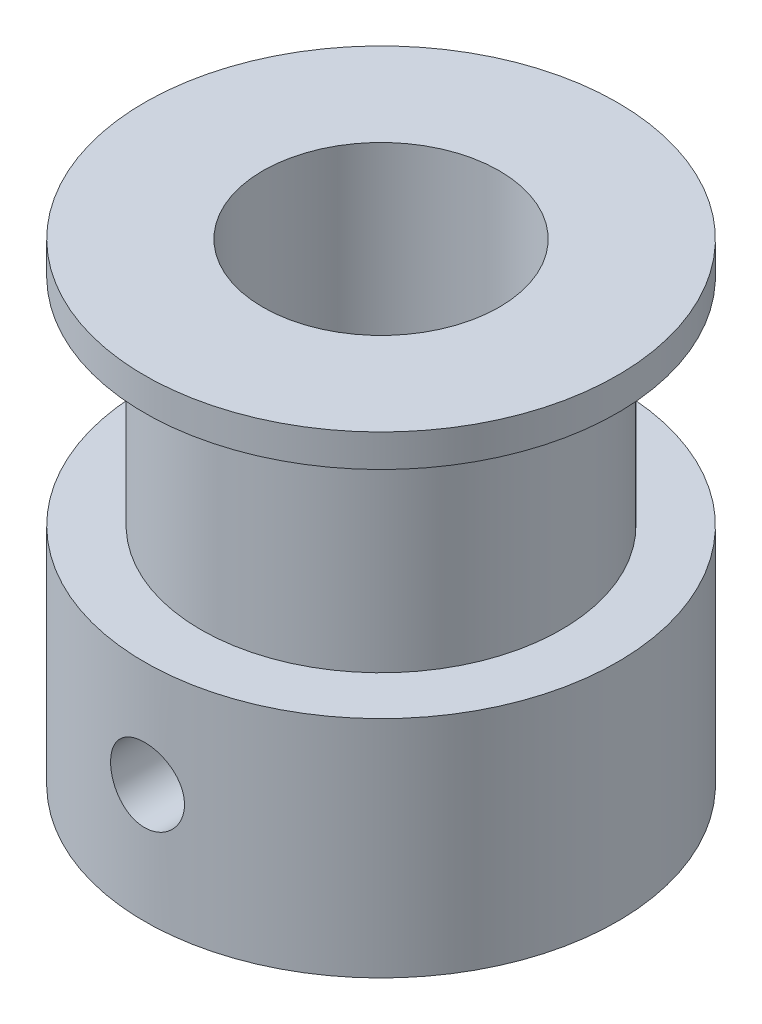
ISO-10303-21;
HEADER;
FILE_DESCRIPTION(('STEP AP214'),'2;1');
FILE_NAME('part.step','',(''),(''),'','','');
FILE_SCHEMA(('AUTOMOTIVE_DESIGN { 1 0 10303 214 1 1 1 1 }'));
ENDSEC;
DATA;
#1=APPLICATION_CONTEXT('core data for automotive mechanical design processes');
#2=APPLICATION_PROTOCOL_DEFINITION('international standard','automotive_design',2000,#1);
#3=PRODUCT_CONTEXT('',#1,'mechanical');
#4=PRODUCT('Part','Part','',(#3));
#5=PRODUCT_RELATED_PRODUCT_CATEGORY('part','',(#4));
#6=PRODUCT_DEFINITION_FORMATION('','',#4);
#7=PRODUCT_DEFINITION_CONTEXT('part definition',#1,'design');
#8=PRODUCT_DEFINITION('design','',#6,#7);
#9=PRODUCT_DEFINITION_SHAPE('','',#8);
#10=(LENGTH_UNIT() NAMED_UNIT(*) SI_UNIT(.MILLI.,.METRE.));
#11=(NAMED_UNIT(*) PLANE_ANGLE_UNIT() SI_UNIT($,.RADIAN.));
#12=(NAMED_UNIT(*) SI_UNIT($,.STERADIAN.) SOLID_ANGLE_UNIT());
#13=UNCERTAINTY_MEASURE_WITH_UNIT(LENGTH_MEASURE(1.E-05),#10,'distance_accuracy_value','');
#14=(GEOMETRIC_REPRESENTATION_CONTEXT(3) GLOBAL_UNCERTAINTY_ASSIGNED_CONTEXT((#13)) GLOBAL_UNIT_ASSIGNED_CONTEXT((#10,
#11,#12)) REPRESENTATION_CONTEXT('',''));
#15=CARTESIAN_POINT('',(0.,0.,0.));
#16=DIRECTION('',(0.,0.,1.));
#17=DIRECTION('',(1.,0.,0.));
#18=AXIS2_PLACEMENT_3D('',#15,#16,#17);
#19=CARTESIAN_POINT('',(-8.,16.,0.));
#20=DIRECTION('',(0.,-1.,0.));
#21=DIRECTION('',(0.,0.,-1.));
#22=AXIS2_PLACEMENT_3D('',#19,#20,#21);
#23=PLANE('',#22);
#24=CARTESIAN_POINT('',(0.,16.,0.));
#25=DIRECTION('',(0.,-1.,0.));
#26=DIRECTION('',(0.,0.,-1.));
#27=AXIS2_PLACEMENT_3D('',#24,#25,#26);
#28=CIRCLE('',#27,8.);
#29=CARTESIAN_POINT('',(0.,16.,-8.));
#30=VERTEX_POINT('',#29);
#31=EDGE_CURVE('E66',#30,#30,#28,.T.);
#32=ORIENTED_EDGE('',*,*,#31,.F.);
#33=EDGE_LOOP('',(#32));
#34=FACE_BOUND('',#33,.T.);
#35=CARTESIAN_POINT('',(0.,16.,0.));
#36=DIRECTION('',(0.,-1.,0.));
#37=DIRECTION('',(0.,0.,-1.));
#38=AXIS2_PLACEMENT_3D('',#35,#36,#37);
#39=CIRCLE('',#38,4.);
#40=CARTESIAN_POINT('',(0.,16.,-4.));
#41=VERTEX_POINT('',#40);
#42=EDGE_CURVE('E10',#41,#41,#39,.T.);
#43=ORIENTED_EDGE('',*,*,#42,.T.);
#44=EDGE_LOOP('',(#43));
#45=FACE_BOUND('',#44,.T.);
#46=ADVANCED_FACE('F38',(#34,#45),#23,.F.);
#47=CARTESIAN_POINT('',(0.,0.,0.));
#48=DIRECTION('',(0.,-1.,0.));
#49=DIRECTION('',(0.,0.,-1.));
#50=AXIS2_PLACEMENT_3D('',#47,#48,#49);
#51=CYLINDRICAL_SURFACE('',#50,4.);
#52=CARTESIAN_POINT('',(-3.79967103839267,4.,1.24999999999998));
#53=CARTESIAN_POINT('',(-3.79967145961937,4.06834703610934,1.24999953780045));
#54=CARTESIAN_POINT('',(-3.80153531505043,4.1366987687032,1.24437538791493));
#55=CARTESIAN_POINT('',(-3.80875638998877,4.27139416087781,1.22209175401325));
#56=CARTESIAN_POINT('',(-3.81411455353136,4.33773727273216,1.20542928782513));
#57=CARTESIAN_POINT('',(-3.8276593883596,4.466444901932,1.16169788223557));
#58=CARTESIAN_POINT('',(-3.83584105194317,4.52881623310568,1.13464735736675));
#59=CARTESIAN_POINT('',(-3.85410406218689,4.64815269586401,1.07096914173155));
#60=CARTESIAN_POINT('',(-3.86418574435841,4.70511686996012,1.0343397590563));
#61=CARTESIAN_POINT('',(-3.8855012766862,4.81397886749348,0.951196070622273));
#62=CARTESIAN_POINT('',(-3.89676123384781,4.86566360943598,0.904409399720379));
#63=CARTESIAN_POINT('',(-3.91894245860336,4.96059601320918,0.802862046455475));
#64=CARTESIAN_POINT('',(-3.92986367872628,5.00384249694484,0.748100252518546));
#65=CARTESIAN_POINT('',(-3.95043553390078,5.08161106301124,0.630625912493344));
#66=CARTESIAN_POINT('',(-3.9600518456278,5.11591370383145,0.567761556520077));
#67=CARTESIAN_POINT('',(-3.97662551833019,5.17337604985554,0.436804232853386));
#68=CARTESIAN_POINT('',(-3.98358350419919,5.19653837414958,0.368712498487035));
#69=CARTESIAN_POINT('',(-3.99387175820862,5.23035112809706,0.231464356966082));
#70=CARTESIAN_POINT('',(-3.99730738984143,5.24136574978784,0.1624057154682));
#71=CARTESIAN_POINT('',(-4.00053595876015,5.25172434643752,0.0233408139845057));
#72=CARTESIAN_POINT('',(-4.00032972410065,5.25107097435882,-0.0466652269730977));
#73=CARTESIAN_POINT('',(-3.99637116132537,5.23835170841405,-0.183074480354748));
#74=CARTESIAN_POINT('',(-3.99274150972157,5.22668061648697,-0.249518634314057));
#75=CARTESIAN_POINT('',(-3.98249482560854,5.19290500995699,-0.379453063347783));
#76=CARTESIAN_POINT('',(-3.97587759827134,5.17079981491344,-0.442943145481208));
#77=CARTESIAN_POINT('',(-3.96023459729532,5.11652981092511,-0.566078103154792));
#78=CARTESIAN_POINT('',(-3.95118033616957,5.08424519143696,-0.625666405622842));
#79=CARTESIAN_POINT('',(-3.93161722953561,5.01062890029543,-0.738702511152039));
#80=CARTESIAN_POINT('',(-3.92110801644584,4.96929494086216,-0.792148756208847));
#81=CARTESIAN_POINT('',(-3.89923670734646,4.8767263651987,-0.89373769845389));
#82=CARTESIAN_POINT('',(-3.88785731989083,4.8251509311588,-0.941566549094187));
#83=CARTESIAN_POINT('',(-3.86590615440412,4.71460489817553,-1.02798974259538));
#84=CARTESIAN_POINT('',(-3.85533447159846,4.65563342942499,-1.06658299775342));
#85=CARTESIAN_POINT('',(-3.83610846648973,4.53108253114015,-1.13380465019766));
#86=CARTESIAN_POINT('',(-3.82747690354323,4.46543659095761,-1.16231680702683));
#87=CARTESIAN_POINT('',(-3.81337545338913,4.32994050810465,-1.20778345948514));
#88=CARTESIAN_POINT('',(-3.80790443033293,4.26009188578952,-1.22474210765794));
#89=CARTESIAN_POINT('',(-3.80099563391872,4.12118004743416,-1.24601485185709));
#90=CARTESIAN_POINT('',(-3.79940466389696,4.05219800376789,-1.25080954353711));
#91=CARTESIAN_POINT('',(-3.80001077463984,3.91441025850184,-1.24896744498308));
#92=CARTESIAN_POINT('',(-3.80220727008389,3.84560453129953,-1.24233242111456));
#93=CARTESIAN_POINT('',(-3.80998957482874,3.71219170334835,-1.21824873513144));
#94=CARTESIAN_POINT('',(-3.81547554101731,3.64752072592601,-1.20111831160538));
#95=CARTESIAN_POINT('',(-3.8291128733166,3.52197820800396,-1.15690373661028));
#96=CARTESIAN_POINT('',(-3.83726467412387,3.46110728907881,-1.12981796171155));
#97=CARTESIAN_POINT('',(-3.85560539653156,3.34296089022825,-1.06557510655875));
#98=CARTESIAN_POINT('',(-3.86584603489733,3.28583858440723,-1.02815147488558));
#99=CARTESIAN_POINT('',(-3.88710348972828,3.17850965363809,-0.944606408679818));
#100=CARTESIAN_POINT('',(-3.89812050735702,3.12830483107467,-0.898482714690791));
#101=CARTESIAN_POINT('',(-3.92024187562679,3.03408963408719,-0.796572947753612));
#102=CARTESIAN_POINT('',(-3.93133092285679,2.99042221386014,-0.740465649788529));
#103=CARTESIAN_POINT('',(-3.95189059843678,2.91310895667875,-0.621451545651407));
#104=CARTESIAN_POINT('',(-3.96136130090946,2.87946266068897,-0.558545051108633));
#105=CARTESIAN_POINT('',(-3.97756311928512,2.82346943752833,-0.428105523331842));
#106=CARTESIAN_POINT('',(-3.984313995612,2.80104071215632,-0.360610184283766));
#107=CARTESIAN_POINT('',(-3.99440242648576,2.7679274614103,-0.222557254056401));
#108=CARTESIAN_POINT('',(-3.99774104914277,2.75723926091651,-0.152000628340368));
#109=CARTESIAN_POINT('',(-4.00055803404461,2.74820899825039,-0.0129849366489113));
#110=CARTESIAN_POINT('',(-4.0001912940739,2.74937154982925,0.0554391919465096));
#111=CARTESIAN_POINT('',(-3.99600978081048,2.7628118110487,0.191073221923235));
#112=CARTESIAN_POINT('',(-3.99219523232619,2.77508879599195,0.258283202179554));
#113=CARTESIAN_POINT('',(-3.98159570844796,2.81009400922228,0.388755118480777));
#114=CARTESIAN_POINT('',(-3.97484847960205,2.83268960784538,0.452055918449466));
#115=CARTESIAN_POINT('',(-3.9590794558795,2.88757082720848,0.573998425500075));
#116=CARTESIAN_POINT('',(-3.95005727091358,2.91985810997344,0.632639331274466));
#117=CARTESIAN_POINT('',(-3.93029896883376,2.99447275834445,0.745761694969672));
#118=CARTESIAN_POINT('',(-3.91951509750962,3.03710352246398,0.800034607053095));
#119=CARTESIAN_POINT('',(-3.89758736547061,3.13065988944347,0.900820791399302));
#120=CARTESIAN_POINT('',(-3.88644339784827,3.18158797413939,0.947331733504142));
#121=CARTESIAN_POINT('',(-3.86461892577438,3.29231571984111,1.03282865911251));
#122=CARTESIAN_POINT('',(-3.85396600863456,3.35235340311658,1.07151427994709));
#123=CARTESIAN_POINT('',(-3.83480125279531,3.47839812026915,1.1382047074852));
#124=CARTESIAN_POINT('',(-3.82628854861387,3.54440272645026,1.16621383403544));
#125=CARTESIAN_POINT('',(-3.81306560440328,3.67472261731467,1.2087118043579));
#126=CARTESIAN_POINT('',(-3.80809315043749,3.73870254745157,1.22414939837871));
#127=CARTESIAN_POINT('',(-3.80139606482399,3.86845383209649,1.24479245816098));
#128=CARTESIAN_POINT('',(-3.79967063301599,3.9342247412015,1.25000044480776));
#129=CARTESIAN_POINT('',(-3.79967103839267,4.,1.24999999999998));
#130=B_SPLINE_CURVE_WITH_KNOTS('',3,(#52,#53,#54,#55,#56,#57,#58,#59,#60,#61,#62,#63,#64,#65,
#66,#67,#68,#69,#70,#71,#72,#73,#74,#75,#76,#77,#78,#79,#80,#81,#82,#83,#84,#85,#86,#87,#88,#89,
#90,#91,#92,#93,#94,#95,#96,#97,#98,#99,#100,#101,#102,#103,#104,#105,#106,#107,#108,#109,#110,
#111,#112,#113,#114,#115,#116,#117,#118,#119,#120,#121,#122,#123,#124,#125,#126,#127,#128,#129),
.UNSPECIFIED.,.T.,.F.,(4,2,2,2,2,2,2,2,2,2,2,2,2,2,2,2,2,2,2,2,2,2,2,2,2,2,2,2,2,2,2,2,2,2,2,2,
2,2,4),(0.,0.20479813754849,0.409651627059734,0.614143644118579,0.818671804924945,
1.02957080550838,1.24049922941122,1.45619821963732,1.67184647417921,1.88083722835533,
2.08978046471773,2.29150982969749,2.49325235190092,2.69746404608408,2.90172742713186,
3.11450338937332,3.32730439853774,3.54248470934452,3.75758763952751,3.96404933287933,
4.17047912219087,4.37093972044361,4.57143302253207,4.77767613309608,4.98397288011877,
5.19881937811508,5.41365603317084,5.62690239290995,5.84008198140582,6.04438802439522,
6.24868074692303,6.45041846514756,6.65219079911648,6.86080693105211,7.06948557772187,
7.28507795501701,7.50058300803818,7.69772354371382,7.89481549188775),.UNSPECIFIED.);
#131=CARTESIAN_POINT('',(-3.79967103839267,4.,1.24999999999998));
#132=VERTEX_POINT('',#131);
#133=EDGE_CURVE('E135',#132,#132,#130,.T.);
#134=ORIENTED_EDGE('',*,*,#133,.T.);
#135=EDGE_LOOP('',(#134));
#136=FACE_BOUND('',#135,.T.);
#137=CARTESIAN_POINT('',(1.24999999999999,4.,3.79967103839267));
#138=CARTESIAN_POINT('',(1.24999953780046,4.06834703610934,3.79967145961936));
#139=CARTESIAN_POINT('',(1.24437538791494,4.1366987687032,3.80153531505043));
#140=CARTESIAN_POINT('',(1.22209175401326,4.27139416087781,3.80875638998877));
#141=CARTESIAN_POINT('',(1.20542928782514,4.33773727273216,3.81411455353136));
#142=CARTESIAN_POINT('',(1.16169788223558,4.466444901932,3.8276593883596));
#143=CARTESIAN_POINT('',(1.13464735736676,4.52881623310568,3.83584105194317));
#144=CARTESIAN_POINT('',(1.07096914173156,4.64815269586401,3.85410406218688));
#145=CARTESIAN_POINT('',(1.03433975905631,4.70511686996012,3.86418574435841));
#146=CARTESIAN_POINT('',(0.951196070622287,4.81397886749348,3.8855012766862));
#147=CARTESIAN_POINT('',(0.904409399720392,4.86566360943598,3.8967612338478));
#148=CARTESIAN_POINT('',(0.802862046455489,4.96059601320918,3.91894245860335));
#149=CARTESIAN_POINT('',(0.748100252518559,5.00384249694484,3.92986367872627));
#150=CARTESIAN_POINT('',(0.630625912493358,5.08161106301124,3.95043553390078));
#151=CARTESIAN_POINT('',(0.56776155652009,5.11591370383145,3.9600518456278));
#152=CARTESIAN_POINT('',(0.436804232853399,5.17337604985554,3.97662551833019));
#153=CARTESIAN_POINT('',(0.368712498487048,5.19653837414958,3.98358350419919));
#154=CARTESIAN_POINT('',(0.231464356966095,5.23035112809706,3.99387175820862));
#155=CARTESIAN_POINT('',(0.162405715468213,5.24136574978784,3.99730738984143));
#156=CARTESIAN_POINT('',(0.0233408139845192,5.25172434643752,4.00053595876015));
#157=CARTESIAN_POINT('',(-0.0466652269730841,5.25107097435882,4.00032972410065));
#158=CARTESIAN_POINT('',(-0.183074480354735,5.23835170841405,3.99637116132537));
#159=CARTESIAN_POINT('',(-0.249518634314044,5.22668061648697,3.99274150972157));
#160=CARTESIAN_POINT('',(-0.379453063347769,5.19290500995699,3.98249482560855));
#161=CARTESIAN_POINT('',(-0.442943145481194,5.17079981491344,3.97587759827134));
#162=CARTESIAN_POINT('',(-0.566078103154779,5.11652981092511,3.96023459729533));
#163=CARTESIAN_POINT('',(-0.625666405622828,5.08424519143696,3.95118033616957));
#164=CARTESIAN_POINT('',(-0.738702511152026,5.01062890029543,3.93161722953562));
#165=CARTESIAN_POINT('',(-0.792148756208834,4.96929494086216,3.92110801644584));
#166=CARTESIAN_POINT('',(-0.893737698453877,4.8767263651987,3.89923670734646));
#167=CARTESIAN_POINT('',(-0.941566549094174,4.8251509311588,3.88785731989084));
#168=CARTESIAN_POINT('',(-1.02798974259537,4.71460489817553,3.86590615440412));
#169=CARTESIAN_POINT('',(-1.06658299775341,4.65563342942499,3.85533447159847));
#170=CARTESIAN_POINT('',(-1.13380465019765,4.53108253114015,3.83610846648974));
#171=CARTESIAN_POINT('',(-1.16231680702681,4.46543659095761,3.82747690354324));
#172=CARTESIAN_POINT('',(-1.20778345948513,4.32994050810465,3.81337545338913));
#173=CARTESIAN_POINT('',(-1.22474210765793,4.26009188578951,3.80790443033294));
#174=CARTESIAN_POINT('',(-1.24601485185708,4.12118004743416,3.80099563391872));
#175=CARTESIAN_POINT('',(-1.2508095435371,4.05219800376789,3.79940466389696));
#176=CARTESIAN_POINT('',(-1.24896744498306,3.91441025850184,3.80001077463985));
#177=CARTESIAN_POINT('',(-1.24233242111455,3.84560453129953,3.8022072700839));
#178=CARTESIAN_POINT('',(-1.21824873513142,3.71219170334835,3.80998957482874));
#179=CARTESIAN_POINT('',(-1.20111831160537,3.64752072592601,3.81547554101732));
#180=CARTESIAN_POINT('',(-1.15690373661027,3.52197820800396,3.82911287331661));
#181=CARTESIAN_POINT('',(-1.12981796171154,3.46110728907881,3.83726467412388));
#182=CARTESIAN_POINT('',(-1.06557510655874,3.34296089022825,3.85560539653156));
#183=CARTESIAN_POINT('',(-1.02815147488557,3.28583858440723,3.86584603489733));
#184=CARTESIAN_POINT('',(-0.944606408679805,3.17850965363809,3.88710348972828));
#185=CARTESIAN_POINT('',(-0.898482714690777,3.12830483107467,3.89812050735703));
#186=CARTESIAN_POINT('',(-0.796572947753598,3.03408963408719,3.92024187562679));
#187=CARTESIAN_POINT('',(-0.740465649788515,2.99042221386014,3.93133092285679));
#188=CARTESIAN_POINT('',(-0.621451545651392,2.91310895667875,3.95189059843678));
#189=CARTESIAN_POINT('',(-0.558545051108618,2.87946266068897,3.96136130090946));
#190=CARTESIAN_POINT('',(-0.428105523331828,2.82346943752832,3.97756311928512));
#191=CARTESIAN_POINT('',(-0.360610184283753,2.80104071215632,3.984313995612));
#192=CARTESIAN_POINT('',(-0.222557254056387,2.7679274614103,3.99440242648576));
#193=CARTESIAN_POINT('',(-0.152000628340354,2.75723926091651,3.99774104914277));
#194=CARTESIAN_POINT('',(-0.0129849366488977,2.74820899825039,4.00055803404461));
#195=CARTESIAN_POINT('',(0.0554391919465228,2.74937154982925,4.0001912940739));
#196=CARTESIAN_POINT('',(0.191073221923248,2.7628118110487,3.99600978081048));
#197=CARTESIAN_POINT('',(0.258283202179568,2.77508879599195,3.99219523232619));
#198=CARTESIAN_POINT('',(0.38875511848079,2.81009400922228,3.98159570844795));
#199=CARTESIAN_POINT('',(0.452055918449479,2.83268960784538,3.97484847960205));
#200=CARTESIAN_POINT('',(0.573998425500089,2.88757082720848,3.9590794558795));
#201=CARTESIAN_POINT('',(0.632639331274479,2.91985810997343,3.95005727091358));
#202=CARTESIAN_POINT('',(0.745761694969686,2.99447275834445,3.93029896883376));
#203=CARTESIAN_POINT('',(0.800034607053108,3.03710352246398,3.91951509750962));
#204=CARTESIAN_POINT('',(0.900820791399315,3.13065988944347,3.89758736547061));
#205=CARTESIAN_POINT('',(0.947331733504156,3.18158797413939,3.88644339784826));
#206=CARTESIAN_POINT('',(1.03282865911252,3.2923157198411,3.86461892577438));
#207=CARTESIAN_POINT('',(1.0715142799471,3.35235340311658,3.85396600863456));
#208=CARTESIAN_POINT('',(1.13820470748521,3.47839812026914,3.83480125279531));
#209=CARTESIAN_POINT('',(1.16621383403545,3.54440272645025,3.82628854861387));
#210=CARTESIAN_POINT('',(1.20871180435792,3.67472261731467,3.81306560440328));
#211=CARTESIAN_POINT('',(1.22414939837873,3.73870254745157,3.80809315043749));
#212=CARTESIAN_POINT('',(1.24479245816099,3.86845383209649,3.80139606482399));
#213=CARTESIAN_POINT('',(1.25000044480778,3.9342247412015,3.79967063301598));
#214=CARTESIAN_POINT('',(1.24999999999999,4.,3.79967103839267));
#215=B_SPLINE_CURVE_WITH_KNOTS('',3,(#137,#138,#139,#140,#141,#142,#143,#144,#145,#146,#147,
#148,#149,#150,#151,#152,#153,#154,#155,#156,#157,#158,#159,#160,#161,#162,#163,#164,#165,#166,
#167,#168,#169,#170,#171,#172,#173,#174,#175,#176,#177,#178,#179,#180,#181,#182,#183,#184,#185,
#186,#187,#188,#189,#190,#191,#192,#193,#194,#195,#196,#197,#198,#199,#200,#201,#202,#203,#204,
#205,#206,#207,#208,#209,#210,#211,#212,#213,#214),.UNSPECIFIED.,.T.,.F.,(4,2,2,2,2,2,2,2,2,2,2,
2,2,2,2,2,2,2,2,2,2,2,2,2,2,2,2,2,2,2,2,2,2,2,2,2,2,2,4),(0.,0.20479813754849,0.409651627059734,
0.614143644118579,0.818671804924945,1.02957080550838,1.24049922941122,1.45619821963733,
1.67184647417921,1.88083722835533,2.08978046471773,2.29150982969749,2.49325235190092,
2.69746404608408,2.90172742713186,3.11450338937332,3.32730439853774,3.54248470934452,
3.75758763952751,3.96404933287933,4.17047912219087,4.37093972044361,4.57143302253207,
4.77767613309608,4.98397288011878,5.19881937811509,5.41365603317084,5.62690239290995,
5.84008198140582,6.04438802439522,6.24868074692303,6.45041846514756,6.65219079911648,
6.86080693105211,7.06948557772187,7.28507795501701,7.50058300803818,7.69772354371382,
7.89481549188775),.UNSPECIFIED.);
#216=CARTESIAN_POINT('',(1.24999999999999,4.,3.79967103839267));
#217=VERTEX_POINT('',#216);
#218=EDGE_CURVE('E77',#217,#217,#215,.T.);
#219=ORIENTED_EDGE('',*,*,#218,.T.);
#220=EDGE_LOOP('',(#219));
#221=FACE_BOUND('',#220,.T.);
#222=ORIENTED_EDGE('',*,*,#42,.F.);
#223=EDGE_LOOP('',(#222));
#224=FACE_BOUND('',#223,.T.);
#225=CARTESIAN_POINT('',(0.,0.,0.));
#226=DIRECTION('',(0.,-1.,0.));
#227=DIRECTION('',(0.,0.,-1.));
#228=AXIS2_PLACEMENT_3D('',#225,#226,#227);
#229=CIRCLE('',#228,4.);
#230=CARTESIAN_POINT('',(0.,0.,-4.));
#231=VERTEX_POINT('',#230);
#232=EDGE_CURVE('E44',#231,#231,#229,.T.);
#233=ORIENTED_EDGE('',*,*,#232,.T.);
#234=EDGE_LOOP('',(#233));
#235=FACE_BOUND('',#234,.T.);
#236=ADVANCED_FACE('F120',(#136,#221,#224,#235),#51,.F.);
#237=CARTESIAN_POINT('',(-4.,0.,0.));
#238=DIRECTION('',(0.,1.,0.));
#239=DIRECTION('',(0.,0.,1.));
#240=AXIS2_PLACEMENT_3D('',#237,#238,#239);
#241=PLANE('',#240);
#242=ORIENTED_EDGE('',*,*,#232,.F.);
#243=EDGE_LOOP('',(#242));
#244=FACE_BOUND('',#243,.T.);
#245=CARTESIAN_POINT('',(0.,0.,0.));
#246=DIRECTION('',(0.,-1.,0.));
#247=DIRECTION('',(0.,0.,-1.));
#248=AXIS2_PLACEMENT_3D('',#245,#246,#247);
#249=CIRCLE('',#248,8.);
#250=CARTESIAN_POINT('',(0.,0.,-8.));
#251=VERTEX_POINT('',#250);
#252=EDGE_CURVE('E48',#251,#251,#249,.T.);
#253=ORIENTED_EDGE('',*,*,#252,.T.);
#254=EDGE_LOOP('',(#253));
#255=FACE_BOUND('',#254,.T.);
#256=ADVANCED_FACE('F115',(#244,#255),#241,.F.);
#257=CARTESIAN_POINT('',(0.,0.,0.));
#258=DIRECTION('',(0.,-1.,0.));
#259=DIRECTION('',(0.,0.,-1.));
#260=AXIS2_PLACEMENT_3D('',#257,#258,#259);
#261=CYLINDRICAL_SURFACE('',#260,8.);
#262=CARTESIAN_POINT('',(-7.90174031463956,4.,1.24999999999997));
#263=CARTESIAN_POINT('',(-7.90174151747695,3.93024831083641,1.24999714589598));
#264=CARTESIAN_POINT('',(-7.90267390208987,3.86045700117776,1.24414188871428));
#265=CARTESIAN_POINT('',(-7.90629985526833,3.72282818551743,1.22088321822906));
#266=CARTESIAN_POINT('',(-7.90899510762377,3.65499261226407,1.20346876400908));
#267=CARTESIAN_POINT('',(-7.91583424559869,3.52328720517116,1.15762758023417));
#268=CARTESIAN_POINT('',(-7.919976983357,3.45941427606284,1.12920957460918));
#269=CARTESIAN_POINT('',(-7.92924294913634,3.33735155458073,1.0621889590823));
#270=CARTESIAN_POINT('',(-7.93436605112925,3.27916103317071,1.02358765802568));
#271=CARTESIAN_POINT('',(-7.94506519257156,3.16960175742389,0.936938650554413));
#272=CARTESIAN_POINT('',(-7.95064443921898,3.11828946280006,0.888819943087436));
#273=CARTESIAN_POINT('',(-7.96159865413737,3.02443288978517,0.784655404938354));
#274=CARTESIAN_POINT('',(-7.96697361085028,2.9818891068879,0.728609126584217));
#275=CARTESIAN_POINT('',(-7.97694733576469,2.9065675614794,0.609817145928766));
#276=CARTESIAN_POINT('',(-7.98154190081689,2.87384199801277,0.547037963178611));
#277=CARTESIAN_POINT('',(-7.98940157455279,2.81942102263748,0.416790085897349));
#278=CARTESIAN_POINT('',(-7.99266675933898,2.79772497930868,0.349321660068375));
#279=CARTESIAN_POINT('',(-7.99747714289859,2.76615064052192,0.212192662724375));
#280=CARTESIAN_POINT('',(-7.99903611302523,2.75617767546583,0.142554380080346));
#281=CARTESIAN_POINT('',(-8.00030565490477,2.74803847834832,0.00257657177530689));
#282=CARTESIAN_POINT('',(-8.00001633772735,2.74987153682409,-0.0677629114946215));
#283=CARTESIAN_POINT('',(-7.99763286949342,2.76521796313894,-0.206500044861103));
#284=CARTESIAN_POINT('',(-7.99555445847991,2.77862946942017,-0.274909271287614));
#285=CARTESIAN_POINT('',(-7.98984386977642,2.81659201431132,-0.408494187671772));
#286=CARTESIAN_POINT('',(-7.98621164936935,2.84114335917707,-0.473669788676113));
#287=CARTESIAN_POINT('',(-7.97777459210141,2.90079182793003,-0.59924371339626));
#288=CARTESIAN_POINT('',(-7.97296503885208,2.93593150271398,-0.659621495359209));
#289=CARTESIAN_POINT('',(-7.96270873510231,3.01572804031463,-0.773661928266089));
#290=CARTESIAN_POINT('',(-7.95726193916408,3.0603855819775,-0.827324099796642));
#291=CARTESIAN_POINT('',(-7.94626939127781,3.15851674353664,-0.927010992600138));
#292=CARTESIAN_POINT('',(-7.94072320355105,3.21207933319744,-0.972948128065395));
#293=CARTESIAN_POINT('',(-7.93021346922373,3.32619878234107,-1.05519613023745));
#294=CARTESIAN_POINT('',(-7.9252499268149,3.38675569213704,-1.0915069276917));
#295=CARTESIAN_POINT('',(-7.91646746408067,3.5132398140529,-1.15348530317845));
#296=CARTESIAN_POINT('',(-7.91264957292445,3.57917178753673,-1.17914331942082));
#297=CARTESIAN_POINT('',(-7.90660844954739,3.71448242435274,-1.21899671563836));
#298=CARTESIAN_POINT('',(-7.90438509485371,3.78386082253486,-1.23319297597631));
#299=CARTESIAN_POINT('',(-7.90180818484429,3.92331405163761,-1.2495985961893));
#300=CARTESIAN_POINT('',(-7.90143522402998,3.99337390009738,-1.25193236705637));
#301=CARTESIAN_POINT('',(-7.9025497488591,4.13288381764895,-1.24487739516594));
#302=CARTESIAN_POINT('',(-7.90403717167621,4.20233390725293,-1.23548904827166));
#303=CARTESIAN_POINT('',(-7.90868700525928,4.33826390373324,-1.2053620627795));
#304=CARTESIAN_POINT('',(-7.91184019416676,4.4047579993198,-1.18468589390992));
#305=CARTESIAN_POINT('',(-7.91945862198423,4.53333698555194,-1.13263536120968));
#306=CARTESIAN_POINT('',(-7.92392393072055,4.59542164132451,-1.10126042801477));
#307=CARTESIAN_POINT('',(-7.93370896103555,4.71397564082441,-1.02840599585149));
#308=CARTESIAN_POINT('',(-7.93903534729881,4.77039511444998,-0.986846255467377));
#309=CARTESIAN_POINT('',(-7.94992252348104,4.8755034904241,-0.894912969976436));
#310=CARTESIAN_POINT('',(-7.95548332780552,4.92419191680351,-0.844538882607125));
#311=CARTESIAN_POINT('',(-7.96627369437276,5.01290563531773,-0.735857733829064));
#312=CARTESIAN_POINT('',(-7.97149979210822,5.05284828821503,-0.677482820794941));
#313=CARTESIAN_POINT('',(-7.98097744670418,5.12235975999511,-0.55477930514671));
#314=CARTESIAN_POINT('',(-7.98522903204154,5.15192888202296,-0.49045087658127));
#315=CARTESIAN_POINT('',(-7.99226348838417,5.19972313764207,-0.357919831889188));
#316=CARTESIAN_POINT('',(-7.9950521112786,5.2179927487197,-0.289733573808569));
#317=CARTESIAN_POINT('',(-7.99887064894726,5.2428130663364,-0.151213974885399));
#318=CARTESIAN_POINT('',(-7.99990069020438,5.24936461567798,-0.0808807888272432));
#319=CARTESIAN_POINT('',(-8.00008455063986,5.2505409263276,0.0591360825941097));
#320=CARTESIAN_POINT('',(-7.99925822019994,5.24529187232136,0.128818714429872));
#321=CARTESIAN_POINT('',(-7.99586239007131,5.22328734190983,0.266297297732406));
#322=CARTESIAN_POINT('',(-7.99329289739779,5.20653191181083,0.334093256790768));
#323=CARTESIAN_POINT('',(-7.98669820710743,5.16203637014377,0.465834425214694));
#324=CARTESIAN_POINT('',(-7.98267426414775,5.13430572420935,0.529782898258183));
#325=CARTESIAN_POINT('',(-7.97361166155728,5.06866058073916,0.652139036265974));
#326=CARTESIAN_POINT('',(-7.96857296339862,5.03074569651355,0.710546490726928));
#327=CARTESIAN_POINT('',(-7.9579764111196,4.94535527839514,0.82080109592932));
#328=CARTESIAN_POINT('',(-7.95241381770965,4.89778684284548,0.872575847413214));
#329=CARTESIAN_POINT('',(-7.94143064388638,4.7946350213348,0.967453563683456));
#330=CARTESIAN_POINT('',(-7.936010097069,4.739049759147,1.01055449281037));
#331=CARTESIAN_POINT('',(-7.92588898732018,4.62103944785431,1.08710075771185));
#332=CARTESIAN_POINT('',(-7.92119304654734,4.5585745206629,1.1204852207414));
#333=CARTESIAN_POINT('',(-7.91310716729584,4.42887839115244,1.1762378280374));
#334=CARTESIAN_POINT('',(-7.90971589257156,4.36165214943308,1.19861725029599));
#335=CARTESIAN_POINT('',(-7.90539548341694,4.24511513015644,1.2267245347863));
#336=CARTESIAN_POINT('',(-7.90403218990729,4.19651920000936,1.23543924637683));
#337=CARTESIAN_POINT('',(-7.90220418687747,4.09862210947501,1.24707794539408));
#338=CARTESIAN_POINT('',(-7.90173946412117,4.04932095948656,1.25000201811807));
#339=CARTESIAN_POINT('',(-7.90174031463956,4.,1.24999999999997));
#340=B_SPLINE_CURVE_WITH_KNOTS('',3,(#262,#263,#264,#265,#266,#267,#268,#269,#270,#271,#272,
#273,#274,#275,#276,#277,#278,#279,#280,#281,#282,#283,#284,#285,#286,#287,#288,#289,#290,#291,
#292,#293,#294,#295,#296,#297,#298,#299,#300,#301,#302,#303,#304,#305,#306,#307,#308,#309,#310,
#311,#312,#313,#314,#315,#316,#317,#318,#319,#320,#321,#322,#323,#324,#325,#326,#327,#328,#329,
#330,#331,#332,#333,#334,#335,#336,#337,#338,#339),.UNSPECIFIED.,.T.,.F.,(4,2,2,2,2,2,2,2,2,2,2,
2,2,2,2,2,2,2,2,2,2,2,2,2,2,2,2,2,2,2,2,2,2,2,2,2,2,2,4),(0.,0.209074763941292,
0.418349516267958,0.627458688206185,0.836540996707031,1.04724629023634,1.25796348710332,
1.46978189009239,1.68158816549378,1.8916719875685,2.10174318513254,2.30998489573483,
2.51823233165379,2.72732806463507,2.93643871601872,3.14778021695734,3.35912323826018,
3.57065555017415,3.78217161301616,3.99146470015319,4.20075071952322,4.4088900672411,
4.61704049339769,4.8268867641658,5.03674594931012,5.24850985997731,5.46026758176484,
5.67118638114209,5.88209000991814,6.0907491703459,6.29940749105002,6.50788624405677,
6.71637291400437,6.92697020198994,7.13761685756286,7.34955610829275,7.56127770816938,
7.70911527287128,7.85695065987999),.UNSPECIFIED.);
#341=CARTESIAN_POINT('',(-7.90174031463956,4.,1.24999999999997));
#342=VERTEX_POINT('',#341);
#343=EDGE_CURVE('E139',#342,#342,#340,.T.);
#344=ORIENTED_EDGE('',*,*,#343,.T.);
#345=EDGE_LOOP('',(#344));
#346=FACE_BOUND('',#345,.T.);
#347=CARTESIAN_POINT('',(1.24999999999999,4.,7.90174031463955));
#348=CARTESIAN_POINT('',(1.24999714589601,3.93024831083641,7.90174151747695));
#349=CARTESIAN_POINT('',(1.24414188871431,3.86045700117776,7.90267390208986));
#350=CARTESIAN_POINT('',(1.22088321822909,3.72282818551743,7.90629985526833));
#351=CARTESIAN_POINT('',(1.20346876400911,3.65499261226407,7.90899510762377));
#352=CARTESIAN_POINT('',(1.1576275802342,3.52328720517116,7.91583424559868));
#353=CARTESIAN_POINT('',(1.12920957460921,3.45941427606284,7.919976983357));
#354=CARTESIAN_POINT('',(1.06218895908233,3.33735155458073,7.92924294913634));
#355=CARTESIAN_POINT('',(1.02358765802571,3.27916103317071,7.93436605112924));
#356=CARTESIAN_POINT('',(0.936938650554441,3.16960175742389,7.94506519257156));
#357=CARTESIAN_POINT('',(0.888819943087464,3.11828946280006,7.95064443921898));
#358=CARTESIAN_POINT('',(0.784655404938381,3.02443288978517,7.96159865413737));
#359=CARTESIAN_POINT('',(0.728609126584245,2.9818891068879,7.96697361085028));
#360=CARTESIAN_POINT('',(0.609817145928794,2.9065675614794,7.97694733576469));
#361=CARTESIAN_POINT('',(0.547037963178639,2.87384199801277,7.98154190081689));
#362=CARTESIAN_POINT('',(0.416790085897377,2.81942102263748,7.98940157455279));
#363=CARTESIAN_POINT('',(0.349321660068403,2.79772497930868,7.99266675933897));
#364=CARTESIAN_POINT('',(0.212192662724403,2.76615064052192,7.99747714289859));
#365=CARTESIAN_POINT('',(0.142554380080374,2.75617767546583,7.99903611302523));
#366=CARTESIAN_POINT('',(0.00257657177533498,2.74803847834832,8.00030565490477));
#367=CARTESIAN_POINT('',(-0.0677629114945935,2.74987153682409,8.00001633772735));
#368=CARTESIAN_POINT('',(-0.206500044861075,2.76521796313894,7.99763286949342));
#369=CARTESIAN_POINT('',(-0.274909271287586,2.77862946942017,7.99555445847991));
#370=CARTESIAN_POINT('',(-0.408494187671744,2.81659201431132,7.98984386977642));
#371=CARTESIAN_POINT('',(-0.473669788676085,2.84114335917707,7.98621164936935));
#372=CARTESIAN_POINT('',(-0.599243713396233,2.90079182793003,7.97777459210141));
#373=CARTESIAN_POINT('',(-0.659621495359181,2.93593150271398,7.97296503885208));
#374=CARTESIAN_POINT('',(-0.773661928266061,3.01572804031463,7.96270873510231));
#375=CARTESIAN_POINT('',(-0.827324099796614,3.0603855819775,7.95726193916408));
#376=CARTESIAN_POINT('',(-0.927010992600111,3.15851674353664,7.94626939127781));
#377=CARTESIAN_POINT('',(-0.972948128065367,3.21207933319744,7.94072320355105));
#378=CARTESIAN_POINT('',(-1.05519613023742,3.32619878234107,7.93021346922373));
#379=CARTESIAN_POINT('',(-1.09150692769167,3.38675569213704,7.92524992681491));
#380=CARTESIAN_POINT('',(-1.15348530317842,3.5132398140529,7.91646746408067));
#381=CARTESIAN_POINT('',(-1.1791433194208,3.57917178753673,7.91264957292446));
#382=CARTESIAN_POINT('',(-1.21899671563833,3.71448242435274,7.9066084495474));
#383=CARTESIAN_POINT('',(-1.23319297597628,3.78386082253486,7.90438509485371));
#384=CARTESIAN_POINT('',(-1.24959859618927,3.92331405163761,7.90180818484429));
#385=CARTESIAN_POINT('',(-1.25193236705635,3.99337390009738,7.90143522402998));
#386=CARTESIAN_POINT('',(-1.24487739516591,4.13288381764895,7.9025497488591));
#387=CARTESIAN_POINT('',(-1.23548904827163,4.20233390725293,7.90403717167622));
#388=CARTESIAN_POINT('',(-1.20536206277947,4.33826390373323,7.90868700525928));
#389=CARTESIAN_POINT('',(-1.18468589390989,4.4047579993198,7.91184019416676));
#390=CARTESIAN_POINT('',(-1.13263536120965,4.53333698555194,7.91945862198424));
#391=CARTESIAN_POINT('',(-1.10126042801474,4.59542164132451,7.92392393072055));
#392=CARTESIAN_POINT('',(-1.02840599585146,4.71397564082441,7.93370896103555));
#393=CARTESIAN_POINT('',(-0.986846255467349,4.77039511444998,7.93903534729881));
#394=CARTESIAN_POINT('',(-0.894912969976408,4.8755034904241,7.94992252348104));
#395=CARTESIAN_POINT('',(-0.844538882607097,4.92419191680351,7.95548332780553));
#396=CARTESIAN_POINT('',(-0.735857733829036,5.01290563531773,7.96627369437276));
#397=CARTESIAN_POINT('',(-0.677482820794914,5.05284828821503,7.97149979210822));
#398=CARTESIAN_POINT('',(-0.554779305146682,5.12235975999511,7.98097744670418));
#399=CARTESIAN_POINT('',(-0.490450876581242,5.15192888202296,7.98522903204154));
#400=CARTESIAN_POINT('',(-0.35791983188916,5.19972313764207,7.99226348838417));
#401=CARTESIAN_POINT('',(-0.289733573808541,5.2179927487197,7.9950521112786));
#402=CARTESIAN_POINT('',(-0.151213974885371,5.2428130663364,7.99887064894726));
#403=CARTESIAN_POINT('',(-0.0808807888272154,5.24936461567798,7.99990069020438));
#404=CARTESIAN_POINT('',(0.0591360825941376,5.2505409263276,8.00008455063986));
#405=CARTESIAN_POINT('',(0.128818714429899,5.24529187232136,7.99925822019994));
#406=CARTESIAN_POINT('',(0.266297297732434,5.22328734190983,7.9958623900713));
#407=CARTESIAN_POINT('',(0.334093256790796,5.20653191181083,7.99329289739778));
#408=CARTESIAN_POINT('',(0.465834425214722,5.16203637014377,7.98669820710743));
#409=CARTESIAN_POINT('',(0.529782898258211,5.13430572420935,7.98267426414775));
#410=CARTESIAN_POINT('',(0.652139036266002,5.06866058073916,7.97361166155728));
#411=CARTESIAN_POINT('',(0.710546490726956,5.03074569651355,7.96857296339862));
#412=CARTESIAN_POINT('',(0.820801095929347,4.94535527839514,7.9579764111196));
#413=CARTESIAN_POINT('',(0.872575847413242,4.89778684284548,7.95241381770964));
#414=CARTESIAN_POINT('',(0.967453563683484,4.7946350213348,7.94143064388637));
#415=CARTESIAN_POINT('',(1.0105544928104,4.739049759147,7.936010097069));
#416=CARTESIAN_POINT('',(1.08710075771188,4.62103944785431,7.92588898732018));
#417=CARTESIAN_POINT('',(1.12048522074143,4.5585745206629,7.92119304654734));
#418=CARTESIAN_POINT('',(1.17623782803743,4.42887839115244,7.91310716729583));
#419=CARTESIAN_POINT('',(1.19861725029601,4.36165214943308,7.90971589257156));
#420=CARTESIAN_POINT('',(1.22672453478633,4.24511513015644,7.90539548341694));
#421=CARTESIAN_POINT('',(1.23543924637686,4.19651920000936,7.90403218990728));
#422=CARTESIAN_POINT('',(1.2470779453941,4.09862210947501,7.90220418687746));
#423=CARTESIAN_POINT('',(1.2500020181181,4.04932095948656,7.90173946412116));
#424=CARTESIAN_POINT('',(1.24999999999999,4.,7.90174031463955));
#425=B_SPLINE_CURVE_WITH_KNOTS('',3,(#347,#348,#349,#350,#351,#352,#353,#354,#355,#356,#357,
#358,#359,#360,#361,#362,#363,#364,#365,#366,#367,#368,#369,#370,#371,#372,#373,#374,#375,#376,
#377,#378,#379,#380,#381,#382,#383,#384,#385,#386,#387,#388,#389,#390,#391,#392,#393,#394,#395,
#396,#397,#398,#399,#400,#401,#402,#403,#404,#405,#406,#407,#408,#409,#410,#411,#412,#413,#414,
#415,#416,#417,#418,#419,#420,#421,#422,#423,#424),.UNSPECIFIED.,.T.,.F.,(4,2,2,2,2,2,2,2,2,2,2,
2,2,2,2,2,2,2,2,2,2,2,2,2,2,2,2,2,2,2,2,2,2,2,2,2,2,2,4),(0.,0.209074763941292,
0.418349516267958,0.627458688206185,0.836540996707031,1.04724629023634,1.25796348710332,
1.46978189009239,1.68158816549378,1.8916719875685,2.10174318513254,2.30998489573483,
2.51823233165379,2.72732806463507,2.93643871601872,3.14778021695734,3.35912323826018,
3.57065555017415,3.78217161301616,3.99146470015319,4.20075071952321,4.4088900672411,
4.61704049339769,4.8268867641658,5.03674594931012,5.24850985997731,5.46026758176484,
5.67118638114209,5.88209000991814,6.0907491703459,6.29940749105002,6.50788624405677,
6.71637291400437,6.92697020198994,7.13761685756286,7.34955610829275,7.56127770816938,
7.70911527287128,7.85695065987999),.UNSPECIFIED.);
#426=CARTESIAN_POINT('',(1.24999999999999,4.,7.90174031463955));
#427=VERTEX_POINT('',#426);
#428=EDGE_CURVE('E69',#427,#427,#425,.T.);
#429=ORIENTED_EDGE('',*,*,#428,.T.);
#430=EDGE_LOOP('',(#429));
#431=FACE_BOUND('',#430,.T.);
#432=ORIENTED_EDGE('',*,*,#252,.F.);
#433=EDGE_LOOP('',(#432));
#434=FACE_BOUND('',#433,.T.);
#435=CARTESIAN_POINT('',(0.,7.6,0.));
#436=DIRECTION('',(0.,-1.,0.));
#437=DIRECTION('',(0.,0.,-1.));
#438=AXIS2_PLACEMENT_3D('',#435,#436,#437);
#439=CIRCLE('',#438,8.);
#440=CARTESIAN_POINT('',(0.,7.6,-8.));
#441=VERTEX_POINT('',#440);
#442=EDGE_CURVE('E52',#441,#441,#439,.T.);
#443=ORIENTED_EDGE('',*,*,#442,.T.);
#444=EDGE_LOOP('',(#443));
#445=FACE_BOUND('',#444,.T.);
#446=ADVANCED_FACE('F83',(#346,#431,#434,#445),#261,.T.);
#447=CARTESIAN_POINT('',(-8.,7.6,0.));
#448=DIRECTION('',(0.,-1.,0.));
#449=DIRECTION('',(0.,0.,-1.));
#450=AXIS2_PLACEMENT_3D('',#447,#448,#449);
#451=PLANE('',#450);
#452=ORIENTED_EDGE('',*,*,#442,.F.);
#453=EDGE_LOOP('',(#452));
#454=FACE_BOUND('',#453,.T.);
#455=CARTESIAN_POINT('',(0.,7.6,0.));
#456=DIRECTION('',(0.,-1.,0.));
#457=DIRECTION('',(0.,0.,-1.));
#458=AXIS2_PLACEMENT_3D('',#455,#456,#457);
#459=CIRCLE('',#458,6.1);
#460=CARTESIAN_POINT('',(0.,7.6,-6.1));
#461=VERTEX_POINT('',#460);
#462=EDGE_CURVE('E57',#461,#461,#459,.T.);
#463=ORIENTED_EDGE('',*,*,#462,.T.);
#464=EDGE_LOOP('',(#463));
#465=FACE_BOUND('',#464,.T.);
#466=ADVANCED_FACE('F108',(#454,#465),#451,.F.);
#467=CARTESIAN_POINT('',(0.,0.,0.));
#468=DIRECTION('',(0.,-1.,0.));
#469=DIRECTION('',(0.,0.,-1.));
#470=AXIS2_PLACEMENT_3D('',#467,#468,#469);
#471=CYLINDRICAL_SURFACE('',#470,6.1);
#472=ORIENTED_EDGE('',*,*,#462,.F.);
#473=EDGE_LOOP('',(#472));
#474=FACE_BOUND('',#473,.T.);
#475=CARTESIAN_POINT('',(0.,14.9,0.));
#476=DIRECTION('',(0.,-1.,0.));
#477=DIRECTION('',(0.,0.,-1.));
#478=AXIS2_PLACEMENT_3D('',#475,#476,#477);
#479=CIRCLE('',#478,6.1);
#480=CARTESIAN_POINT('',(0.,14.9,-6.1));
#481=VERTEX_POINT('',#480);
#482=EDGE_CURVE('E60',#481,#481,#479,.T.);
#483=ORIENTED_EDGE('',*,*,#482,.T.);
#484=EDGE_LOOP('',(#483));
#485=FACE_BOUND('',#484,.T.);
#486=ADVANCED_FACE('F105',(#474,#485),#471,.T.);
#487=CARTESIAN_POINT('',(-6.1,14.9,0.));
#488=DIRECTION('',(0.,1.,0.));
#489=DIRECTION('',(0.,0.,1.));
#490=AXIS2_PLACEMENT_3D('',#487,#488,#489);
#491=PLANE('',#490);
#492=ORIENTED_EDGE('',*,*,#482,.F.);
#493=EDGE_LOOP('',(#492));
#494=FACE_BOUND('',#493,.T.);
#495=CARTESIAN_POINT('',(0.,14.9,0.));
#496=DIRECTION('',(0.,-1.,0.));
#497=DIRECTION('',(0.,0.,-1.));
#498=AXIS2_PLACEMENT_3D('',#495,#496,#497);
#499=CIRCLE('',#498,8.);
#500=CARTESIAN_POINT('',(0.,14.9,-8.));
#501=VERTEX_POINT('',#500);
#502=EDGE_CURVE('E63',#501,#501,#499,.T.);
#503=ORIENTED_EDGE('',*,*,#502,.T.);
#504=EDGE_LOOP('',(#503));
#505=FACE_BOUND('',#504,.T.);
#506=ADVANCED_FACE('F101',(#494,#505),#491,.F.);
#507=CARTESIAN_POINT('',(0.,0.,0.));
#508=DIRECTION('',(0.,-1.,0.));
#509=DIRECTION('',(0.,0.,-1.));
#510=AXIS2_PLACEMENT_3D('',#507,#508,#509);
#511=CYLINDRICAL_SURFACE('',#510,8.);
#512=ORIENTED_EDGE('',*,*,#502,.F.);
#513=EDGE_LOOP('',(#512));
#514=FACE_BOUND('',#513,.T.);
#515=ORIENTED_EDGE('',*,*,#31,.T.);
#516=EDGE_LOOP('',(#515));
#517=FACE_BOUND('',#516,.T.);
#518=ADVANCED_FACE('F92',(#514,#517),#511,.T.);
#519=CARTESIAN_POINT('',(0.,4.,8.));
#520=DIRECTION('',(0.,0.,1.));
#521=DIRECTION('',(1.,0.,0.));
#522=AXIS2_PLACEMENT_3D('',#519,#520,#521);
#523=CYLINDRICAL_SURFACE('',#522,1.24999999999999);
#524=ORIENTED_EDGE('',*,*,#218,.F.);
#525=EDGE_LOOP('',(#524));
#526=FACE_BOUND('',#525,.T.);
#527=ORIENTED_EDGE('',*,*,#428,.F.);
#528=EDGE_LOOP('',(#527));
#529=FACE_BOUND('',#528,.T.);
#530=ADVANCED_FACE('F87',(#526,#529),#523,.F.);
#531=CARTESIAN_POINT('',(-8.,4.,0.));
#532=DIRECTION('',(-1.,0.,0.));
#533=DIRECTION('',(0.,0.,1.));
#534=AXIS2_PLACEMENT_3D('',#531,#532,#533);
#535=CYLINDRICAL_SURFACE('',#534,1.24999999999999);
#536=ORIENTED_EDGE('',*,*,#133,.F.);
#537=EDGE_LOOP('',(#536));
#538=FACE_BOUND('',#537,.T.);
#539=ORIENTED_EDGE('',*,*,#343,.F.);
#540=EDGE_LOOP('',(#539));
#541=FACE_BOUND('',#540,.T.);
#542=ADVANCED_FACE('F91',(#538,#541),#535,.F.);
#543=CLOSED_SHELL('',(#46,#236,#256,#446,#466,#486,#506,#518,#530,#542));
#544=MANIFOLD_SOLID_BREP('B2',#543);
#545=ADVANCED_BREP_SHAPE_REPRESENTATION('',(#18,#544),#14);
#546=SHAPE_DEFINITION_REPRESENTATION(#9,#545);
ENDSEC;
END-ISO-10303-21;
